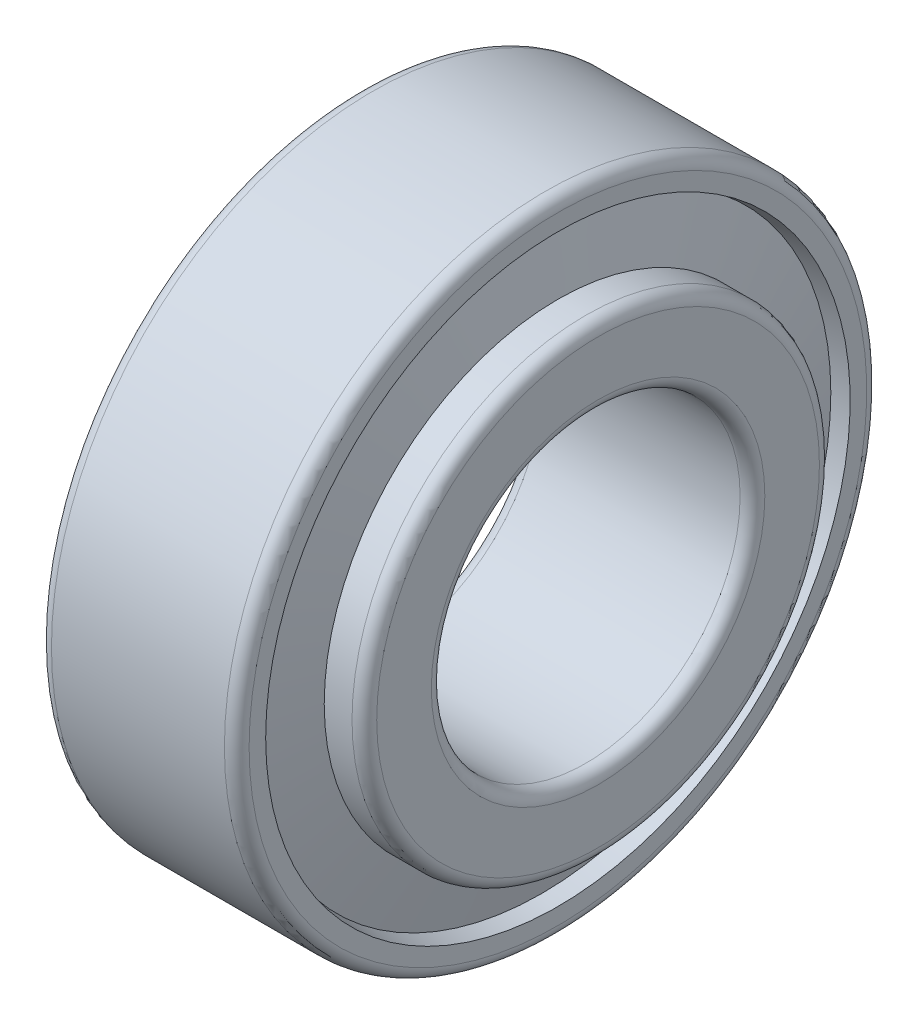
ISO-10303-21;
HEADER;
FILE_DESCRIPTION(('STEP AP214'),'2;1');
FILE_NAME('part.step','',(''),(''),'','','');
FILE_SCHEMA(('AUTOMOTIVE_DESIGN { 1 0 10303 214 1 1 1 1 }'));
ENDSEC;
DATA;
#1=APPLICATION_CONTEXT('core data for automotive mechanical design processes');
#2=APPLICATION_PROTOCOL_DEFINITION('international standard','automotive_design',2000,#1);
#3=PRODUCT_CONTEXT('',#1,'mechanical');
#4=PRODUCT('Part','Part','',(#3));
#5=PRODUCT_RELATED_PRODUCT_CATEGORY('part','',(#4));
#6=PRODUCT_DEFINITION_FORMATION('','',#4);
#7=PRODUCT_DEFINITION_CONTEXT('part definition',#1,'design');
#8=PRODUCT_DEFINITION('design','',#6,#7);
#9=PRODUCT_DEFINITION_SHAPE('','',#8);
#10=(LENGTH_UNIT() NAMED_UNIT(*) SI_UNIT(.MILLI.,.METRE.));
#11=(NAMED_UNIT(*) PLANE_ANGLE_UNIT() SI_UNIT($,.RADIAN.));
#12=(NAMED_UNIT(*) SI_UNIT($,.STERADIAN.) SOLID_ANGLE_UNIT());
#13=UNCERTAINTY_MEASURE_WITH_UNIT(LENGTH_MEASURE(1.E-05),#10,'distance_accuracy_value','');
#14=(GEOMETRIC_REPRESENTATION_CONTEXT(3) GLOBAL_UNCERTAINTY_ASSIGNED_CONTEXT((#13)) GLOBAL_UNIT_ASSIGNED_CONTEXT((#10,
#11,#12)) REPRESENTATION_CONTEXT('',''));
#15=CARTESIAN_POINT('',(0.,0.,0.));
#16=DIRECTION('',(0.,0.,1.));
#17=DIRECTION('',(1.,0.,0.));
#18=AXIS2_PLACEMENT_3D('',#15,#16,#17);
#19=CARTESIAN_POINT('',(2.85335365821338,0.,0.));
#20=DIRECTION('',(-1.,0.,0.));
#21=DIRECTION('',(0.,0.,1.));
#22=AXIS2_PLACEMENT_3D('',#19,#20,#21);
#23=CONICAL_SURFACE('',#22,21.1992501438427,1.33517687777565);
#24=CARTESIAN_POINT('',(4.45670731642689,0.,0.));
#25=DIRECTION('',(-1.,0.,0.));
#26=DIRECTION('',(0.,0.,1.));
#27=AXIS2_PLACEMENT_3D('',#24,#25,#26);
#28=CIRCLE('',#27,14.5208015199127);
#29=CARTESIAN_POINT('',(4.45670731642689,0.,14.5208015199127));
#30=VERTEX_POINT('',#29);
#31=EDGE_CURVE('E112',#30,#30,#28,.T.);
#32=ORIENTED_EDGE('',*,*,#31,.F.);
#33=EDGE_LOOP('',(#32));
#34=FACE_BOUND('',#33,.T.);
#35=CARTESIAN_POINT('',(2.85335365821338,0.,0.));
#36=DIRECTION('',(-1.,0.,0.));
#37=DIRECTION('',(0.,0.,1.));
#38=AXIS2_PLACEMENT_3D('',#35,#36,#37);
#39=CIRCLE('',#38,21.1992501438427);
#40=CARTESIAN_POINT('',(2.85335365821338,0.,21.1992501438427));
#41=VERTEX_POINT('',#40);
#42=EDGE_CURVE('E10',#41,#41,#39,.T.);
#43=ORIENTED_EDGE('',*,*,#42,.T.);
#44=EDGE_LOOP('',(#43));
#45=FACE_BOUND('',#44,.T.);
#46=ADVANCED_FACE('F37',(#34,#45),#23,.F.);
#47=CARTESIAN_POINT('',(0.,0.,0.));
#48=DIRECTION('',(1.,0.,0.));
#49=DIRECTION('',(0.,0.,-1.));
#50=AXIS2_PLACEMENT_3D('',#47,#48,#49);
#51=CONICAL_SURFACE('',#50,20.6655,0.184923471938431);
#52=ORIENTED_EDGE('',*,*,#42,.F.);
#53=EDGE_LOOP('',(#52));
#54=FACE_BOUND('',#53,.T.);
#55=CARTESIAN_POINT('',(0.,0.,0.));
#56=DIRECTION('',(-1.,0.,0.));
#57=DIRECTION('',(0.,0.,1.));
#58=AXIS2_PLACEMENT_3D('',#55,#56,#57);
#59=CIRCLE('',#58,20.6655);
#60=CARTESIAN_POINT('',(0.,0.,20.6655));
#61=VERTEX_POINT('',#60);
#62=EDGE_CURVE('E44',#61,#61,#59,.T.);
#63=ORIENTED_EDGE('',*,*,#62,.T.);
#64=EDGE_LOOP('',(#63));
#65=FACE_BOUND('',#64,.T.);
#66=ADVANCED_FACE('F120',(#54,#65),#51,.F.);
#67=CARTESIAN_POINT('',(0.,20.6655,0.));
#68=DIRECTION('',(1.,0.,0.));
#69=DIRECTION('',(0.,0.,-1.));
#70=AXIS2_PLACEMENT_3D('',#67,#68,#69);
#71=PLANE('',#70);
#72=ORIENTED_EDGE('',*,*,#62,.F.);
#73=EDGE_LOOP('',(#72));
#74=FACE_BOUND('',#73,.T.);
#75=CARTESIAN_POINT('',(0.,0.,0.));
#76=DIRECTION('',(-1.,0.,0.));
#77=DIRECTION('',(0.,0.,1.));
#78=AXIS2_PLACEMENT_3D('',#75,#76,#77);
#79=CIRCLE('',#78,25.);
#80=CARTESIAN_POINT('',(0.,0.,25.));
#81=VERTEX_POINT('',#80);
#82=EDGE_CURVE('E49',#81,#81,#79,.T.);
#83=ORIENTED_EDGE('',*,*,#82,.T.);
#84=EDGE_LOOP('',(#83));
#85=FACE_BOUND('',#84,.T.);
#86=ADVANCED_FACE('F124',(#74,#85),#71,.F.);
#87=CARTESIAN_POINT('',(1.,0.,0.));
#88=DIRECTION('',(-1.,0.,0.));
#89=DIRECTION('',(0.,0.,1.));
#90=AXIS2_PLACEMENT_3D('',#87,#88,#89);
#91=TOROIDAL_SURFACE('',#90,25.,1.);
#92=ORIENTED_EDGE('',*,*,#82,.F.);
#93=EDGE_LOOP('',(#92));
#94=FACE_BOUND('',#93,.T.);
#95=CARTESIAN_POINT('',(1.,0.,0.));
#96=DIRECTION('',(-1.,0.,0.));
#97=DIRECTION('',(0.,0.,1.));
#98=AXIS2_PLACEMENT_3D('',#95,#96,#97);
#99=CIRCLE('',#98,26.);
#100=CARTESIAN_POINT('',(1.,0.,26.));
#101=VERTEX_POINT('',#100);
#102=EDGE_CURVE('E54',#101,#101,#99,.T.);
#103=ORIENTED_EDGE('',*,*,#102,.T.);
#104=EDGE_LOOP('',(#103));
#105=FACE_BOUND('',#104,.T.);
#106=ADVANCED_FACE('F129',(#94,#105),#91,.T.);
#107=CARTESIAN_POINT('',(-882.527700014444,0.,0.));
#108=DIRECTION('',(-1.,0.,0.));
#109=DIRECTION('',(0.,0.,1.));
#110=AXIS2_PLACEMENT_3D('',#107,#108,#109);
#111=CYLINDRICAL_SURFACE('',#110,26.);
#112=ORIENTED_EDGE('',*,*,#102,.F.);
#113=EDGE_LOOP('',(#112));
#114=FACE_BOUND('',#113,.T.);
#115=CARTESIAN_POINT('',(15.,0.,0.));
#116=DIRECTION('',(-1.,0.,0.));
#117=DIRECTION('',(0.,0.,1.));
#118=AXIS2_PLACEMENT_3D('',#115,#116,#117);
#119=CIRCLE('',#118,26.);
#120=CARTESIAN_POINT('',(15.,0.,26.));
#121=VERTEX_POINT('',#120);
#122=EDGE_CURVE('E60',#121,#121,#119,.T.);
#123=ORIENTED_EDGE('',*,*,#122,.T.);
#124=EDGE_LOOP('',(#123));
#125=FACE_BOUND('',#124,.T.);
#126=ADVANCED_FACE('F135',(#114,#125),#111,.T.);
#127=CARTESIAN_POINT('',(15.,0.,0.));
#128=DIRECTION('',(-1.,0.,0.));
#129=DIRECTION('',(0.,0.,1.));
#130=AXIS2_PLACEMENT_3D('',#127,#128,#129);
#131=TOROIDAL_SURFACE('',#130,25.,1.);
#132=ORIENTED_EDGE('',*,*,#122,.F.);
#133=EDGE_LOOP('',(#132));
#134=FACE_BOUND('',#133,.T.);
#135=CARTESIAN_POINT('',(16.,0.,0.));
#136=DIRECTION('',(-1.,0.,0.));
#137=DIRECTION('',(0.,0.,1.));
#138=AXIS2_PLACEMENT_3D('',#135,#136,#137);
#139=CIRCLE('',#138,25.);
#140=CARTESIAN_POINT('',(16.,0.,25.));
#141=VERTEX_POINT('',#140);
#142=EDGE_CURVE('E64',#141,#141,#139,.T.);
#143=ORIENTED_EDGE('',*,*,#142,.T.);
#144=EDGE_LOOP('',(#143));
#145=FACE_BOUND('',#144,.T.);
#146=ADVANCED_FACE('F139',(#134,#145),#131,.T.);
#147=CARTESIAN_POINT('',(16.,25.,0.));
#148=DIRECTION('',(-1.,0.,0.));
#149=DIRECTION('',(0.,0.,1.));
#150=AXIS2_PLACEMENT_3D('',#147,#148,#149);
#151=PLANE('',#150);
#152=ORIENTED_EDGE('',*,*,#142,.F.);
#153=EDGE_LOOP('',(#152));
#154=FACE_BOUND('',#153,.T.);
#155=CARTESIAN_POINT('',(16.,0.,0.));
#156=DIRECTION('',(-1.,0.,0.));
#157=DIRECTION('',(0.,0.,1.));
#158=AXIS2_PLACEMENT_3D('',#155,#156,#157);
#159=CIRCLE('',#158,23.6584701412582);
#160=CARTESIAN_POINT('',(16.,0.,23.6584701412582));
#161=VERTEX_POINT('',#160);
#162=EDGE_CURVE('E68',#161,#161,#159,.T.);
#163=ORIENTED_EDGE('',*,*,#162,.T.);
#164=EDGE_LOOP('',(#163));
#165=FACE_BOUND('',#164,.T.);
#166=ADVANCED_FACE('F143',(#154,#165),#151,.F.);
#167=CARTESIAN_POINT('',(14.6813427895892,0.,0.));
#168=DIRECTION('',(1.,0.,0.));
#169=DIRECTION('',(0.,0.,-1.));
#170=AXIS2_PLACEMENT_3D('',#167,#168,#169);
#171=CONICAL_SURFACE('',#170,23.411801287676,0.184923471938423);
#172=ORIENTED_EDGE('',*,*,#162,.F.);
#173=EDGE_LOOP('',(#172));
#174=FACE_BOUND('',#173,.T.);
#175=CARTESIAN_POINT('',(14.6813427895892,0.,0.));
#176=DIRECTION('',(-1.,0.,0.));
#177=DIRECTION('',(0.,0.,1.));
#178=AXIS2_PLACEMENT_3D('',#175,#176,#177);
#179=CIRCLE('',#178,23.411801287676);
#180=CARTESIAN_POINT('',(14.6813427895892,0.,23.411801287676));
#181=VERTEX_POINT('',#180);
#182=EDGE_CURVE('E72',#181,#181,#179,.T.);
#183=ORIENTED_EDGE('',*,*,#182,.T.);
#184=EDGE_LOOP('',(#183));
#185=FACE_BOUND('',#184,.T.);
#186=ADVANCED_FACE('F147',(#174,#185),#171,.F.);
#187=CARTESIAN_POINT('',(16.,0.,0.));
#188=DIRECTION('',(-1.,0.,0.));
#189=DIRECTION('',(0.,0.,1.));
#190=AXIS2_PLACEMENT_3D('',#187,#188,#189);
#191=CONICAL_SURFACE('',#190,17.919198712324,1.33517687777566);
#192=ORIENTED_EDGE('',*,*,#182,.F.);
#193=EDGE_LOOP('',(#192));
#194=FACE_BOUND('',#193,.T.);
#195=CARTESIAN_POINT('',(16.,0.,0.));
#196=DIRECTION('',(-1.,0.,0.));
#197=DIRECTION('',(0.,0.,1.));
#198=AXIS2_PLACEMENT_3D('',#195,#196,#197);
#199=CIRCLE('',#198,17.919198712324);
#200=CARTESIAN_POINT('',(16.,0.,17.919198712324));
#201=VERTEX_POINT('',#200);
#202=EDGE_CURVE('E76',#201,#201,#199,.T.);
#203=ORIENTED_EDGE('',*,*,#202,.T.);
#204=EDGE_LOOP('',(#203));
#205=FACE_BOUND('',#204,.T.);
#206=ADVANCED_FACE('F151',(#194,#205),#191,.T.);
#207=CARTESIAN_POINT('',(16.,18.919198712324,0.));
#208=DIRECTION('',(1.,0.,0.));
#209=DIRECTION('',(0.,0.,-1.));
#210=AXIS2_PLACEMENT_3D('',#207,#208,#209);
#211=PLANE('',#210);
#212=ORIENTED_EDGE('',*,*,#202,.F.);
#213=EDGE_LOOP('',(#212));
#214=FACE_BOUND('',#213,.T.);
#215=CARTESIAN_POINT('',(16.,0.,0.));
#216=DIRECTION('',(-1.,0.,0.));
#217=DIRECTION('',(0.,0.,1.));
#218=AXIS2_PLACEMENT_3D('',#215,#216,#217);
#219=CIRCLE('',#218,18.919198712324);
#220=CARTESIAN_POINT('',(16.,0.,18.919198712324));
#221=VERTEX_POINT('',#220);
#222=EDGE_CURVE('E80',#221,#221,#219,.T.);
#223=ORIENTED_EDGE('',*,*,#222,.T.);
#224=EDGE_LOOP('',(#223));
#225=FACE_BOUND('',#224,.T.);
#226=ADVANCED_FACE('F155',(#214,#225),#211,.F.);
#227=CARTESIAN_POINT('',(-882.527700014444,0.,0.));
#228=DIRECTION('',(-1.,0.,0.));
#229=DIRECTION('',(0.,0.,1.));
#230=AXIS2_PLACEMENT_3D('',#227,#228,#229);
#231=CYLINDRICAL_SURFACE('',#230,18.919198712324);
#232=ORIENTED_EDGE('',*,*,#222,.F.);
#233=EDGE_LOOP('',(#232));
#234=FACE_BOUND('',#233,.T.);
#235=CARTESIAN_POINT('',(18.25,0.,0.));
#236=DIRECTION('',(-1.,0.,0.));
#237=DIRECTION('',(0.,0.,1.));
#238=AXIS2_PLACEMENT_3D('',#235,#236,#237);
#239=CIRCLE('',#238,18.919198712324);
#240=CARTESIAN_POINT('',(18.25,0.,18.919198712324));
#241=VERTEX_POINT('',#240);
#242=EDGE_CURVE('E84',#241,#241,#239,.T.);
#243=ORIENTED_EDGE('',*,*,#242,.T.);
#244=EDGE_LOOP('',(#243));
#245=FACE_BOUND('',#244,.T.);
#246=ADVANCED_FACE('F159',(#234,#245),#231,.T.);
#247=CARTESIAN_POINT('',(18.25,0.,0.));
#248=DIRECTION('',(-1.,0.,0.));
#249=DIRECTION('',(0.,0.,1.));
#250=AXIS2_PLACEMENT_3D('',#247,#248,#249);
#251=TOROIDAL_SURFACE('',#250,17.919198712324,1.);
#252=ORIENTED_EDGE('',*,*,#242,.F.);
#253=EDGE_LOOP('',(#252));
#254=FACE_BOUND('',#253,.T.);
#255=CARTESIAN_POINT('',(19.25,0.,0.));
#256=DIRECTION('',(-1.,0.,0.));
#257=DIRECTION('',(0.,0.,1.));
#258=AXIS2_PLACEMENT_3D('',#255,#256,#257);
#259=CIRCLE('',#258,17.919198712324);
#260=CARTESIAN_POINT('',(19.25,0.,17.919198712324));
#261=VERTEX_POINT('',#260);
#262=EDGE_CURVE('E88',#261,#261,#259,.T.);
#263=ORIENTED_EDGE('',*,*,#262,.T.);
#264=EDGE_LOOP('',(#263));
#265=FACE_BOUND('',#264,.T.);
#266=ADVANCED_FACE('F163',(#254,#265),#251,.T.);
#267=CARTESIAN_POINT('',(19.25,13.5,0.));
#268=DIRECTION('',(-1.,0.,0.));
#269=DIRECTION('',(0.,0.,1.));
#270=AXIS2_PLACEMENT_3D('',#267,#268,#269);
#271=PLANE('',#270);
#272=ORIENTED_EDGE('',*,*,#262,.F.);
#273=EDGE_LOOP('',(#272));
#274=FACE_BOUND('',#273,.T.);
#275=CARTESIAN_POINT('',(19.25,0.,0.));
#276=DIRECTION('',(-1.,0.,0.));
#277=DIRECTION('',(0.,0.,1.));
#278=AXIS2_PLACEMENT_3D('',#275,#276,#277);
#279=CIRCLE('',#278,13.5);
#280=CARTESIAN_POINT('',(19.25,0.,13.5));
#281=VERTEX_POINT('',#280);
#282=EDGE_CURVE('E92',#281,#281,#279,.T.);
#283=ORIENTED_EDGE('',*,*,#282,.T.);
#284=EDGE_LOOP('',(#283));
#285=FACE_BOUND('',#284,.T.);
#286=ADVANCED_FACE('F167',(#274,#285),#271,.F.);
#287=CARTESIAN_POINT('',(18.25,0.,0.));
#288=DIRECTION('',(-1.,0.,0.));
#289=DIRECTION('',(0.,0.,1.));
#290=AXIS2_PLACEMENT_3D('',#287,#288,#289);
#291=TOROIDAL_SURFACE('',#290,13.5,1.);
#292=ORIENTED_EDGE('',*,*,#282,.F.);
#293=EDGE_LOOP('',(#292));
#294=FACE_BOUND('',#293,.T.);
#295=CARTESIAN_POINT('',(18.25,0.,0.));
#296=DIRECTION('',(-1.,0.,0.));
#297=DIRECTION('',(0.,0.,1.));
#298=AXIS2_PLACEMENT_3D('',#295,#296,#297);
#299=CIRCLE('',#298,12.5);
#300=CARTESIAN_POINT('',(18.25,0.,12.5));
#301=VERTEX_POINT('',#300);
#302=EDGE_CURVE('E96',#301,#301,#299,.T.);
#303=ORIENTED_EDGE('',*,*,#302,.T.);
#304=EDGE_LOOP('',(#303));
#305=FACE_BOUND('',#304,.T.);
#306=ADVANCED_FACE('F171',(#294,#305),#291,.T.);
#307=CARTESIAN_POINT('',(-882.527700014444,0.,0.));
#308=DIRECTION('',(-1.,0.,0.));
#309=DIRECTION('',(0.,0.,1.));
#310=AXIS2_PLACEMENT_3D('',#307,#308,#309);
#311=CYLINDRICAL_SURFACE('',#310,12.5);
#312=ORIENTED_EDGE('',*,*,#302,.F.);
#313=EDGE_LOOP('',(#312));
#314=FACE_BOUND('',#313,.T.);
#315=CARTESIAN_POINT('',(2.24999999999997,0.,0.));
#316=DIRECTION('',(-1.,0.,0.));
#317=DIRECTION('',(0.,0.,1.));
#318=AXIS2_PLACEMENT_3D('',#315,#316,#317);
#319=CIRCLE('',#318,12.5);
#320=CARTESIAN_POINT('',(2.24999999999997,0.,12.5));
#321=VERTEX_POINT('',#320);
#322=EDGE_CURVE('E100',#321,#321,#319,.T.);
#323=ORIENTED_EDGE('',*,*,#322,.T.);
#324=EDGE_LOOP('',(#323));
#325=FACE_BOUND('',#324,.T.);
#326=ADVANCED_FACE('F175',(#314,#325),#311,.F.);
#327=CARTESIAN_POINT('',(2.25,0.,0.));
#328=DIRECTION('',(-1.,0.,0.));
#329=DIRECTION('',(0.,0.,1.));
#330=AXIS2_PLACEMENT_3D('',#327,#328,#329);
#331=TOROIDAL_SURFACE('',#330,13.5,1.);
#332=ORIENTED_EDGE('',*,*,#322,.F.);
#333=EDGE_LOOP('',(#332));
#334=FACE_BOUND('',#333,.T.);
#335=CARTESIAN_POINT('',(1.24999999999997,0.,0.));
#336=DIRECTION('',(-1.,0.,0.));
#337=DIRECTION('',(0.,0.,1.));
#338=AXIS2_PLACEMENT_3D('',#335,#336,#337);
#339=CIRCLE('',#338,13.5);
#340=CARTESIAN_POINT('',(1.24999999999997,0.,13.5));
#341=VERTEX_POINT('',#340);
#342=EDGE_CURVE('E104',#341,#341,#339,.T.);
#343=ORIENTED_EDGE('',*,*,#342,.T.);
#344=EDGE_LOOP('',(#343));
#345=FACE_BOUND('',#344,.T.);
#346=ADVANCED_FACE('F179',(#334,#345),#331,.T.);
#347=CARTESIAN_POINT('',(1.25,14.5208015199127,0.));
#348=DIRECTION('',(1.,0.,0.));
#349=DIRECTION('',(0.,0.,-1.));
#350=AXIS2_PLACEMENT_3D('',#347,#348,#349);
#351=PLANE('',#350);
#352=ORIENTED_EDGE('',*,*,#342,.F.);
#353=EDGE_LOOP('',(#352));
#354=FACE_BOUND('',#353,.T.);
#355=CARTESIAN_POINT('',(1.24999999999997,0.,0.));
#356=DIRECTION('',(-1.,0.,0.));
#357=DIRECTION('',(0.,0.,1.));
#358=AXIS2_PLACEMENT_3D('',#355,#356,#357);
#359=CIRCLE('',#358,14.5208015199127);
#360=CARTESIAN_POINT('',(1.24999999999997,0.,14.5208015199127));
#361=VERTEX_POINT('',#360);
#362=EDGE_CURVE('E108',#361,#361,#359,.T.);
#363=ORIENTED_EDGE('',*,*,#362,.T.);
#364=EDGE_LOOP('',(#363));
#365=FACE_BOUND('',#364,.T.);
#366=ADVANCED_FACE('F183',(#354,#365),#351,.F.);
#367=CARTESIAN_POINT('',(-882.527700014444,0.,0.));
#368=DIRECTION('',(-1.,0.,0.));
#369=DIRECTION('',(0.,0.,1.));
#370=AXIS2_PLACEMENT_3D('',#367,#368,#369);
#371=CYLINDRICAL_SURFACE('',#370,14.5208015199127);
#372=ORIENTED_EDGE('',*,*,#362,.F.);
#373=EDGE_LOOP('',(#372));
#374=FACE_BOUND('',#373,.T.);
#375=ORIENTED_EDGE('',*,*,#31,.T.);
#376=EDGE_LOOP('',(#375));
#377=FACE_BOUND('',#376,.T.);
#378=ADVANCED_FACE('F117',(#374,#377),#371,.T.);
#379=CLOSED_SHELL('',(#46,#66,#86,#106,#126,#146,#166,#186,#206,#226,#246,#266,#286,#306,#326,
#346,#366,#378));
#380=MANIFOLD_SOLID_BREP('B2',#379);
#381=ADVANCED_BREP_SHAPE_REPRESENTATION('',(#18,#380),#14);
#382=SHAPE_DEFINITION_REPRESENTATION(#9,#381);
ENDSEC;
END-ISO-10303-21;
